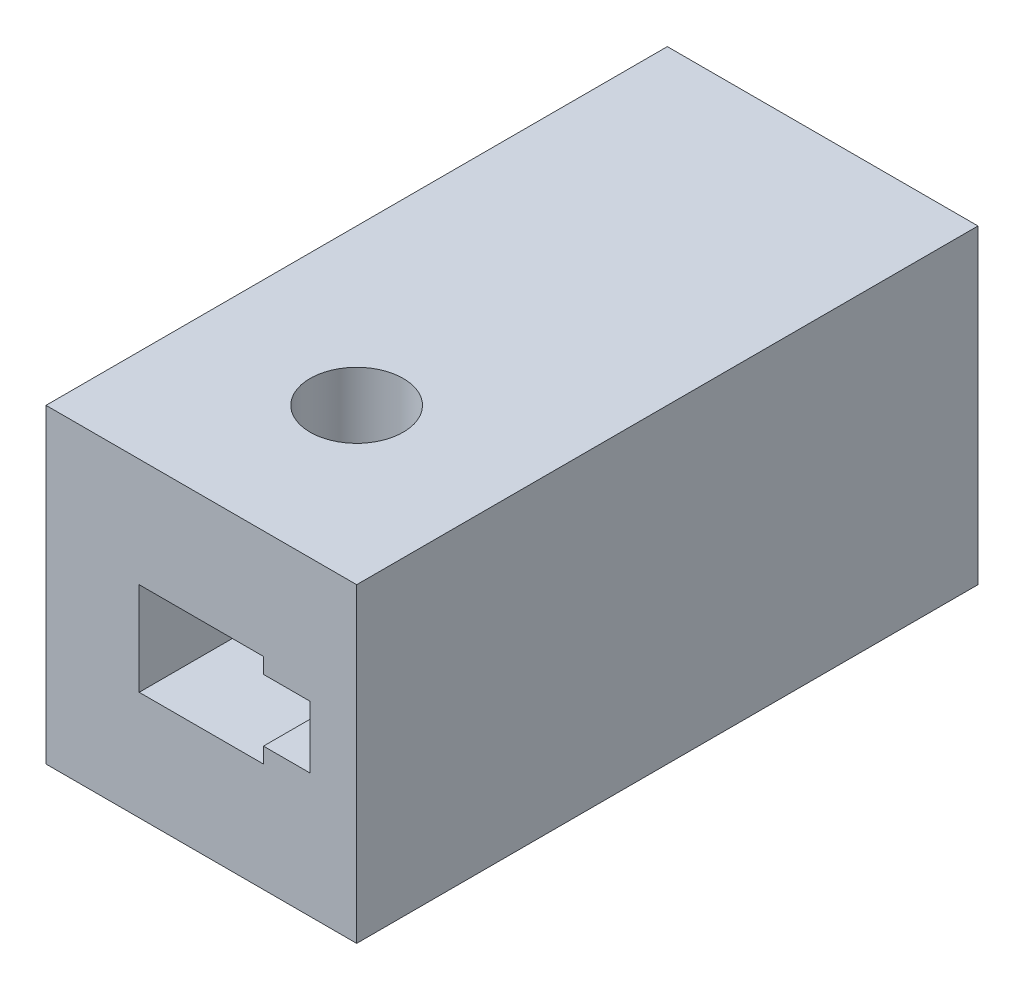
ISO-10303-21;
HEADER;
FILE_DESCRIPTION(('STEP AP214'),'2;1');
FILE_NAME('part.step','',(''),(''),'','','');
FILE_SCHEMA(('AUTOMOTIVE_DESIGN { 1 0 10303 214 1 1 1 1 }'));
ENDSEC;
DATA;
#1=APPLICATION_CONTEXT('core data for automotive mechanical design processes');
#2=APPLICATION_PROTOCOL_DEFINITION('international standard','automotive_design',2000,#1);
#3=PRODUCT_CONTEXT('',#1,'mechanical');
#4=PRODUCT('Part','Part','',(#3));
#5=PRODUCT_RELATED_PRODUCT_CATEGORY('part','',(#4));
#6=PRODUCT_DEFINITION_FORMATION('','',#4);
#7=PRODUCT_DEFINITION_CONTEXT('part definition',#1,'design');
#8=PRODUCT_DEFINITION('design','',#6,#7);
#9=PRODUCT_DEFINITION_SHAPE('','',#8);
#10=(LENGTH_UNIT() NAMED_UNIT(*) SI_UNIT(.MILLI.,.METRE.));
#11=(NAMED_UNIT(*) PLANE_ANGLE_UNIT() SI_UNIT($,.RADIAN.));
#12=(NAMED_UNIT(*) SI_UNIT($,.STERADIAN.) SOLID_ANGLE_UNIT());
#13=UNCERTAINTY_MEASURE_WITH_UNIT(LENGTH_MEASURE(1.E-05),#10,'distance_accuracy_value','');
#14=(GEOMETRIC_REPRESENTATION_CONTEXT(3) GLOBAL_UNCERTAINTY_ASSIGNED_CONTEXT((#13)) GLOBAL_UNIT_ASSIGNED_CONTEXT((#10,
#11,#12)) REPRESENTATION_CONTEXT('',''));
#15=CARTESIAN_POINT('',(0.,0.,0.));
#16=DIRECTION('',(0.,0.,1.));
#17=DIRECTION('',(1.,0.,0.));
#18=AXIS2_PLACEMENT_3D('',#15,#16,#17);
#19=CARTESIAN_POINT('',(0.,-5.,20.));
#20=DIRECTION('',(0.,1.,0.));
#21=DIRECTION('',(0.,0.,1.));
#22=AXIS2_PLACEMENT_3D('',#19,#20,#21);
#23=PLANE('',#22);
#24=CARTESIAN_POINT('',(0.,-5.,15.));
#25=DIRECTION('',(0.,-1.,0.));
#26=DIRECTION('',(0.,0.,-1.));
#27=AXIS2_PLACEMENT_3D('',#24,#25,#26);
#28=CIRCLE('',#27,1.5);
#29=CARTESIAN_POINT('',(0.,-5.,13.5));
#30=VERTEX_POINT('',#29);
#31=EDGE_CURVE('E294',#30,#30,#28,.T.);
#32=ORIENTED_EDGE('',*,*,#31,.F.);
#33=EDGE_LOOP('',(#32));
#34=FACE_BOUND('',#33,.T.);
#35=DIRECTION('',(1.,0.,0.));
#36=VECTOR('',#35,1.);
#37=CARTESIAN_POINT('',(0.,-5.,0.));
#38=LINE('',#37,#36);
#39=CARTESIAN_POINT('',(-5.,-5.,0.));
#40=VERTEX_POINT('',#39);
#41=CARTESIAN_POINT('',(5.,-5.,0.));
#42=VERTEX_POINT('',#41);
#43=EDGE_CURVE('E181',#40,#42,#38,.T.);
#44=ORIENTED_EDGE('',*,*,#43,.T.);
#45=DIRECTION('',(0.,0.,-1.));
#46=VECTOR('',#45,1.);
#47=CARTESIAN_POINT('',(5.,-5.,20.));
#48=LINE('',#47,#46);
#49=CARTESIAN_POINT('',(5.,-5.,20.));
#50=VERTEX_POINT('',#49);
#51=EDGE_CURVE('E11',#50,#42,#48,.T.);
#52=ORIENTED_EDGE('',*,*,#51,.F.);
#53=DIRECTION('',(1.,0.,0.));
#54=VECTOR('',#53,1.);
#55=CARTESIAN_POINT('',(0.,-5.,20.));
#56=LINE('',#55,#54);
#57=CARTESIAN_POINT('',(-5.,-5.,20.));
#58=VERTEX_POINT('',#57);
#59=EDGE_CURVE('E142',#58,#50,#56,.T.);
#60=ORIENTED_EDGE('',*,*,#59,.F.);
#61=DIRECTION('',(0.,0.,-1.));
#62=VECTOR('',#61,1.);
#63=CARTESIAN_POINT('',(-5.,-5.,20.));
#64=LINE('',#63,#62);
#65=EDGE_CURVE('E57',#58,#40,#64,.T.);
#66=ORIENTED_EDGE('',*,*,#65,.T.);
#67=EDGE_LOOP('',(#44,#52,#60,#66));
#68=FACE_BOUND('',#67,.T.);
#69=ADVANCED_FACE('F38',(#34,#68),#23,.F.);
#70=CARTESIAN_POINT('',(5.,0.,20.));
#71=DIRECTION('',(-1.,0.,0.));
#72=DIRECTION('',(0.,0.,1.));
#73=AXIS2_PLACEMENT_3D('',#70,#71,#72);
#74=PLANE('',#73);
#75=DIRECTION('',(0.,1.,0.));
#76=VECTOR('',#75,1.);
#77=CARTESIAN_POINT('',(5.,0.,0.));
#78=LINE('',#77,#76);
#79=CARTESIAN_POINT('',(5.,5.,0.));
#80=VERTEX_POINT('',#79);
#81=EDGE_CURVE('E148',#42,#80,#78,.T.);
#82=ORIENTED_EDGE('',*,*,#81,.T.);
#83=DIRECTION('',(0.,0.,-1.));
#84=VECTOR('',#83,1.);
#85=CARTESIAN_POINT('',(5.,5.,20.));
#86=LINE('',#85,#84);
#87=CARTESIAN_POINT('',(5.,5.,20.));
#88=VERTEX_POINT('',#87);
#89=EDGE_CURVE('E48',#88,#80,#86,.T.);
#90=ORIENTED_EDGE('',*,*,#89,.F.);
#91=DIRECTION('',(0.,1.,0.));
#92=VECTOR('',#91,1.);
#93=CARTESIAN_POINT('',(5.,0.,20.));
#94=LINE('',#93,#92);
#95=EDGE_CURVE('E136',#50,#88,#94,.T.);
#96=ORIENTED_EDGE('',*,*,#95,.F.);
#97=ORIENTED_EDGE('',*,*,#51,.T.);
#98=EDGE_LOOP('',(#82,#90,#96,#97));
#99=FACE_BOUND('',#98,.T.);
#100=ADVANCED_FACE('F147',(#99),#74,.F.);
#101=CARTESIAN_POINT('',(0.,5.,20.));
#102=DIRECTION('',(0.,1.,0.));
#103=DIRECTION('',(0.,0.,1.));
#104=AXIS2_PLACEMENT_3D('',#101,#102,#103);
#105=PLANE('',#104);
#106=CARTESIAN_POINT('',(0.,5.,15.));
#107=DIRECTION('',(0.,1.,0.));
#108=DIRECTION('',(0.,0.,1.));
#109=AXIS2_PLACEMENT_3D('',#106,#107,#108);
#110=CIRCLE('',#109,1.5);
#111=CARTESIAN_POINT('',(0.,5.,16.5));
#112=VERTEX_POINT('',#111);
#113=EDGE_CURVE('E163',#112,#112,#110,.T.);
#114=ORIENTED_EDGE('',*,*,#113,.F.);
#115=EDGE_LOOP('',(#114));
#116=FACE_BOUND('',#115,.T.);
#117=DIRECTION('',(1.,0.,0.));
#118=VECTOR('',#117,1.);
#119=CARTESIAN_POINT('',(0.,5.,0.));
#120=LINE('',#119,#118);
#121=CARTESIAN_POINT('',(-5.,5.,0.));
#122=VERTEX_POINT('',#121);
#123=EDGE_CURVE('E184',#122,#80,#120,.T.);
#124=ORIENTED_EDGE('',*,*,#123,.F.);
#125=DIRECTION('',(0.,0.,-1.));
#126=VECTOR('',#125,1.);
#127=CARTESIAN_POINT('',(-5.,5.,20.));
#128=LINE('',#127,#126);
#129=CARTESIAN_POINT('',(-5.,5.,20.));
#130=VERTEX_POINT('',#129);
#131=EDGE_CURVE('E95',#130,#122,#128,.T.);
#132=ORIENTED_EDGE('',*,*,#131,.F.);
#133=DIRECTION('',(1.,0.,0.));
#134=VECTOR('',#133,1.);
#135=CARTESIAN_POINT('',(0.,5.,20.));
#136=LINE('',#135,#134);
#137=EDGE_CURVE('E141',#130,#88,#136,.T.);
#138=ORIENTED_EDGE('',*,*,#137,.T.);
#139=ORIENTED_EDGE('',*,*,#89,.T.);
#140=EDGE_LOOP('',(#124,#132,#138,#139));
#141=FACE_BOUND('',#140,.T.);
#142=ADVANCED_FACE('F152',(#116,#141),#105,.T.);
#143=CARTESIAN_POINT('',(3.5,0.,20.));
#144=DIRECTION('',(-1.,0.,0.));
#145=DIRECTION('',(0.,0.,1.));
#146=AXIS2_PLACEMENT_3D('',#143,#144,#145);
#147=PLANE('',#146);
#148=DIRECTION('',(0.,1.,0.));
#149=VECTOR('',#148,1.);
#150=CARTESIAN_POINT('',(3.5,0.,0.));
#151=LINE('',#150,#149);
#152=CARTESIAN_POINT('',(3.5,-1.,0.));
#153=VERTEX_POINT('',#152);
#154=CARTESIAN_POINT('',(3.5,0.999999999999998,0.));
#155=VERTEX_POINT('',#154);
#156=EDGE_CURVE('E159',#153,#155,#151,.T.);
#157=ORIENTED_EDGE('',*,*,#156,.F.);
#158=DIRECTION('',(0.,0.,-1.));
#159=VECTOR('',#158,1.);
#160=CARTESIAN_POINT('',(3.5,-1.,20.));
#161=LINE('',#160,#159);
#162=CARTESIAN_POINT('',(3.5,-1.,20.));
#163=VERTEX_POINT('',#162);
#164=EDGE_CURVE('E107',#163,#153,#161,.T.);
#165=ORIENTED_EDGE('',*,*,#164,.F.);
#166=DIRECTION('',(0.,1.,0.));
#167=VECTOR('',#166,1.);
#168=CARTESIAN_POINT('',(3.5,0.,20.));
#169=LINE('',#168,#167);
#170=CARTESIAN_POINT('',(3.5,0.999999999999998,20.));
#171=VERTEX_POINT('',#170);
#172=EDGE_CURVE('E189',#163,#171,#169,.T.);
#173=ORIENTED_EDGE('',*,*,#172,.T.);
#174=DIRECTION('',(0.,0.,-1.));
#175=VECTOR('',#174,1.);
#176=CARTESIAN_POINT('',(3.5,0.999999999999998,20.));
#177=LINE('',#176,#175);
#178=EDGE_CURVE('E155',#171,#155,#177,.T.);
#179=ORIENTED_EDGE('',*,*,#178,.T.);
#180=EDGE_LOOP('',(#157,#165,#173,#179));
#181=FACE_BOUND('',#180,.T.);
#182=ADVANCED_FACE('F40',(#181),#147,.T.);
#183=CARTESIAN_POINT('',(0.,-1.,20.));
#184=DIRECTION('',(0.,1.,0.));
#185=DIRECTION('',(0.,0.,1.));
#186=AXIS2_PLACEMENT_3D('',#183,#184,#185);
#187=PLANE('',#186);
#188=DIRECTION('',(1.,0.,0.));
#189=VECTOR('',#188,1.);
#190=CARTESIAN_POINT('',(0.,-1.,0.));
#191=LINE('',#190,#189);
#192=CARTESIAN_POINT('',(2.,-1.,0.));
#193=VERTEX_POINT('',#192);
#194=EDGE_CURVE('E162',#193,#153,#191,.T.);
#195=ORIENTED_EDGE('',*,*,#194,.F.);
#196=DIRECTION('',(0.,0.,-1.));
#197=VECTOR('',#196,1.);
#198=CARTESIAN_POINT('',(2.,-1.,20.));
#199=LINE('',#198,#197);
#200=CARTESIAN_POINT('',(2.,-1.,20.));
#201=VERTEX_POINT('',#200);
#202=EDGE_CURVE('E204',#201,#193,#199,.T.);
#203=ORIENTED_EDGE('',*,*,#202,.F.);
#204=DIRECTION('',(1.,0.,0.));
#205=VECTOR('',#204,1.);
#206=CARTESIAN_POINT('',(0.,-1.,20.));
#207=LINE('',#206,#205);
#208=EDGE_CURVE('E210',#201,#163,#207,.T.);
#209=ORIENTED_EDGE('',*,*,#208,.T.);
#210=ORIENTED_EDGE('',*,*,#164,.T.);
#211=EDGE_LOOP('',(#195,#203,#209,#210));
#212=FACE_BOUND('',#211,.T.);
#213=ADVANCED_FACE('F208',(#212),#187,.T.);
#214=CARTESIAN_POINT('',(2.,0.,20.));
#215=DIRECTION('',(-1.,0.,0.));
#216=DIRECTION('',(0.,0.,1.));
#217=AXIS2_PLACEMENT_3D('',#214,#215,#216);
#218=PLANE('',#217);
#219=DIRECTION('',(0.,1.,0.));
#220=VECTOR('',#219,1.);
#221=CARTESIAN_POINT('',(2.,0.,0.));
#222=LINE('',#221,#220);
#223=CARTESIAN_POINT('',(2.,-1.5,0.));
#224=VERTEX_POINT('',#223);
#225=EDGE_CURVE('E166',#224,#193,#222,.T.);
#226=ORIENTED_EDGE('',*,*,#225,.F.);
#227=DIRECTION('',(0.,0.,-1.));
#228=VECTOR('',#227,1.);
#229=CARTESIAN_POINT('',(2.,-1.5,20.));
#230=LINE('',#229,#228);
#231=CARTESIAN_POINT('',(2.,-1.5,20.));
#232=VERTEX_POINT('',#231);
#233=EDGE_CURVE('E202',#232,#224,#230,.T.);
#234=ORIENTED_EDGE('',*,*,#233,.F.);
#235=DIRECTION('',(0.,1.,0.));
#236=VECTOR('',#235,1.);
#237=CARTESIAN_POINT('',(2.,0.,20.));
#238=LINE('',#237,#236);
#239=EDGE_CURVE('E223',#232,#201,#238,.T.);
#240=ORIENTED_EDGE('',*,*,#239,.T.);
#241=ORIENTED_EDGE('',*,*,#202,.T.);
#242=EDGE_LOOP('',(#226,#234,#240,#241));
#243=FACE_BOUND('',#242,.T.);
#244=ADVANCED_FACE('F220',(#243),#218,.T.);
#245=CARTESIAN_POINT('',(0.,-1.5,20.));
#246=DIRECTION('',(0.,1.,0.));
#247=DIRECTION('',(0.,0.,1.));
#248=AXIS2_PLACEMENT_3D('',#245,#246,#247);
#249=PLANE('',#248);
#250=CARTESIAN_POINT('',(0.,-1.5,15.));
#251=DIRECTION('',(0.,1.,0.));
#252=DIRECTION('',(0.,0.,1.));
#253=AXIS2_PLACEMENT_3D('',#250,#251,#252);
#254=CIRCLE('',#253,1.5);
#255=CARTESIAN_POINT('',(0.,-1.5,16.5));
#256=VERTEX_POINT('',#255);
#257=EDGE_CURVE('E292',#256,#256,#254,.T.);
#258=ORIENTED_EDGE('',*,*,#257,.F.);
#259=EDGE_LOOP('',(#258));
#260=FACE_BOUND('',#259,.T.);
#261=DIRECTION('',(1.,0.,0.));
#262=VECTOR('',#261,1.);
#263=CARTESIAN_POINT('',(0.,-1.5,0.));
#264=LINE('',#263,#262);
#265=CARTESIAN_POINT('',(-2.,-1.5,0.));
#266=VERTEX_POINT('',#265);
#267=EDGE_CURVE('E169',#266,#224,#264,.T.);
#268=ORIENTED_EDGE('',*,*,#267,.F.);
#269=DIRECTION('',(0.,0.,-1.));
#270=VECTOR('',#269,1.);
#271=CARTESIAN_POINT('',(-2.,-1.5,20.));
#272=LINE('',#271,#270);
#273=CARTESIAN_POINT('',(-2.,-1.5,20.));
#274=VERTEX_POINT('',#273);
#275=EDGE_CURVE('E200',#274,#266,#272,.T.);
#276=ORIENTED_EDGE('',*,*,#275,.F.);
#277=DIRECTION('',(1.,0.,0.));
#278=VECTOR('',#277,1.);
#279=CARTESIAN_POINT('',(0.,-1.5,20.));
#280=LINE('',#279,#278);
#281=EDGE_CURVE('E228',#274,#232,#280,.T.);
#282=ORIENTED_EDGE('',*,*,#281,.T.);
#283=ORIENTED_EDGE('',*,*,#233,.T.);
#284=EDGE_LOOP('',(#268,#276,#282,#283));
#285=FACE_BOUND('',#284,.T.);
#286=ADVANCED_FACE('F309',(#260,#285),#249,.T.);
#287=CARTESIAN_POINT('',(-2.,0.,20.));
#288=DIRECTION('',(-1.,0.,0.));
#289=DIRECTION('',(0.,0.,1.));
#290=AXIS2_PLACEMENT_3D('',#287,#288,#289);
#291=PLANE('',#290);
#292=DIRECTION('',(0.,1.,0.));
#293=VECTOR('',#292,1.);
#294=CARTESIAN_POINT('',(-2.,0.,0.));
#295=LINE('',#294,#293);
#296=CARTESIAN_POINT('',(-2.,1.5,0.));
#297=VERTEX_POINT('',#296);
#298=EDGE_CURVE('E173',#266,#297,#295,.T.);
#299=ORIENTED_EDGE('',*,*,#298,.T.);
#300=DIRECTION('',(0.,0.,-1.));
#301=VECTOR('',#300,1.);
#302=CARTESIAN_POINT('',(-2.,1.5,20.));
#303=LINE('',#302,#301);
#304=CARTESIAN_POINT('',(-2.,1.5,20.));
#305=VERTEX_POINT('',#304);
#306=EDGE_CURVE('E197',#305,#297,#303,.T.);
#307=ORIENTED_EDGE('',*,*,#306,.F.);
#308=DIRECTION('',(0.,1.,0.));
#309=VECTOR('',#308,1.);
#310=CARTESIAN_POINT('',(-2.,0.,20.));
#311=LINE('',#310,#309);
#312=EDGE_CURVE('E235',#274,#305,#311,.T.);
#313=ORIENTED_EDGE('',*,*,#312,.F.);
#314=ORIENTED_EDGE('',*,*,#275,.T.);
#315=EDGE_LOOP('',(#299,#307,#313,#314));
#316=FACE_BOUND('',#315,.T.);
#317=ADVANCED_FACE('F304',(#316),#291,.F.);
#318=CARTESIAN_POINT('',(0.,1.5,20.));
#319=DIRECTION('',(0.,1.,0.));
#320=DIRECTION('',(0.,0.,1.));
#321=AXIS2_PLACEMENT_3D('',#318,#319,#320);
#322=PLANE('',#321);
#323=CARTESIAN_POINT('',(0.,1.5,15.));
#324=DIRECTION('',(0.,1.,0.));
#325=DIRECTION('',(0.,0.,1.));
#326=AXIS2_PLACEMENT_3D('',#323,#324,#325);
#327=CIRCLE('',#326,1.5);
#328=CARTESIAN_POINT('',(0.,1.5,16.5));
#329=VERTEX_POINT('',#328);
#330=EDGE_CURVE('E42',#329,#329,#327,.T.);
#331=ORIENTED_EDGE('',*,*,#330,.T.);
#332=EDGE_LOOP('',(#331));
#333=FACE_BOUND('',#332,.T.);
#334=DIRECTION('',(1.,0.,0.));
#335=VECTOR('',#334,1.);
#336=CARTESIAN_POINT('',(0.,1.5,0.));
#337=LINE('',#336,#335);
#338=CARTESIAN_POINT('',(2.,1.5,0.));
#339=VERTEX_POINT('',#338);
#340=EDGE_CURVE('E175',#297,#339,#337,.T.);
#341=ORIENTED_EDGE('',*,*,#340,.T.);
#342=DIRECTION('',(0.,0.,-1.));
#343=VECTOR('',#342,1.);
#344=CARTESIAN_POINT('',(2.,1.5,20.));
#345=LINE('',#344,#343);
#346=CARTESIAN_POINT('',(2.,1.5,20.));
#347=VERTEX_POINT('',#346);
#348=EDGE_CURVE('E195',#347,#339,#345,.T.);
#349=ORIENTED_EDGE('',*,*,#348,.F.);
#350=DIRECTION('',(1.,0.,0.));
#351=VECTOR('',#350,1.);
#352=CARTESIAN_POINT('',(0.,1.5,20.));
#353=LINE('',#352,#351);
#354=EDGE_CURVE('E237',#305,#347,#353,.T.);
#355=ORIENTED_EDGE('',*,*,#354,.F.);
#356=ORIENTED_EDGE('',*,*,#306,.T.);
#357=EDGE_LOOP('',(#341,#349,#355,#356));
#358=FACE_BOUND('',#357,.T.);
#359=ADVANCED_FACE('F251',(#333,#358),#322,.F.);
#360=CARTESIAN_POINT('',(2.,0.999999999999998,0.));
#361=VERTEX_POINT('',#360);
#362=EDGE_CURVE('E170',#361,#339,#222,.T.);
#363=ORIENTED_EDGE('',*,*,#362,.F.);
#364=DIRECTION('',(0.,0.,-1.));
#365=VECTOR('',#364,1.);
#366=CARTESIAN_POINT('',(2.,0.999999999999998,20.));
#367=LINE('',#366,#365);
#368=CARTESIAN_POINT('',(2.,0.999999999999998,20.));
#369=VERTEX_POINT('',#368);
#370=EDGE_CURVE('E193',#369,#361,#367,.T.);
#371=ORIENTED_EDGE('',*,*,#370,.F.);
#372=EDGE_CURVE('E230',#369,#347,#238,.T.);
#373=ORIENTED_EDGE('',*,*,#372,.T.);
#374=ORIENTED_EDGE('',*,*,#348,.T.);
#375=EDGE_LOOP('',(#363,#371,#373,#374));
#376=FACE_BOUND('',#375,.T.);
#377=ADVANCED_FACE('F245',(#376),#218,.T.);
#378=CARTESIAN_POINT('',(0.,0.999999999999998,20.));
#379=DIRECTION('',(0.,1.,0.));
#380=DIRECTION('',(0.,0.,1.));
#381=AXIS2_PLACEMENT_3D('',#378,#379,#380);
#382=PLANE('',#381);
#383=DIRECTION('',(1.,0.,0.));
#384=VECTOR('',#383,1.);
#385=CARTESIAN_POINT('',(0.,0.999999999999998,0.));
#386=LINE('',#385,#384);
#387=EDGE_CURVE('E178',#361,#155,#386,.T.);
#388=ORIENTED_EDGE('',*,*,#387,.T.);
#389=ORIENTED_EDGE('',*,*,#178,.F.);
#390=DIRECTION('',(1.,0.,0.));
#391=VECTOR('',#390,1.);
#392=CARTESIAN_POINT('',(0.,0.999999999999998,20.));
#393=LINE('',#392,#391);
#394=EDGE_CURVE('E239',#369,#171,#393,.T.);
#395=ORIENTED_EDGE('',*,*,#394,.F.);
#396=ORIENTED_EDGE('',*,*,#370,.T.);
#397=EDGE_LOOP('',(#388,#389,#395,#396));
#398=FACE_BOUND('',#397,.T.);
#399=ADVANCED_FACE('F255',(#398),#382,.F.);
#400=CARTESIAN_POINT('',(-5.,0.,20.));
#401=DIRECTION('',(-1.,0.,0.));
#402=DIRECTION('',(0.,0.,1.));
#403=AXIS2_PLACEMENT_3D('',#400,#401,#402);
#404=PLANE('',#403);
#405=DIRECTION('',(0.,1.,0.));
#406=VECTOR('',#405,1.);
#407=CARTESIAN_POINT('',(-5.,0.,0.));
#408=LINE('',#407,#406);
#409=EDGE_CURVE('E186',#40,#122,#408,.T.);
#410=ORIENTED_EDGE('',*,*,#409,.F.);
#411=ORIENTED_EDGE('',*,*,#65,.F.);
#412=DIRECTION('',(0.,1.,0.));
#413=VECTOR('',#412,1.);
#414=CARTESIAN_POINT('',(-5.,0.,20.));
#415=LINE('',#414,#413);
#416=EDGE_CURVE('E153',#58,#130,#415,.T.);
#417=ORIENTED_EDGE('',*,*,#416,.T.);
#418=ORIENTED_EDGE('',*,*,#131,.T.);
#419=EDGE_LOOP('',(#410,#411,#417,#418));
#420=FACE_BOUND('',#419,.T.);
#421=ADVANCED_FACE('F257',(#420),#404,.T.);
#422=CARTESIAN_POINT('',(0.,0.,20.));
#423=DIRECTION('',(0.,0.,1.));
#424=DIRECTION('',(1.,0.,0.));
#425=AXIS2_PLACEMENT_3D('',#422,#423,#424);
#426=PLANE('',#425);
#427=ORIENTED_EDGE('',*,*,#172,.F.);
#428=ORIENTED_EDGE('',*,*,#208,.F.);
#429=ORIENTED_EDGE('',*,*,#239,.F.);
#430=ORIENTED_EDGE('',*,*,#281,.F.);
#431=ORIENTED_EDGE('',*,*,#312,.T.);
#432=ORIENTED_EDGE('',*,*,#354,.T.);
#433=ORIENTED_EDGE('',*,*,#372,.F.);
#434=ORIENTED_EDGE('',*,*,#394,.T.);
#435=EDGE_LOOP('',(#427,#428,#429,#430,#431,#432,#433,#434));
#436=FACE_BOUND('',#435,.T.);
#437=ORIENTED_EDGE('',*,*,#59,.T.);
#438=ORIENTED_EDGE('',*,*,#95,.T.);
#439=ORIENTED_EDGE('',*,*,#137,.F.);
#440=ORIENTED_EDGE('',*,*,#416,.F.);
#441=EDGE_LOOP('',(#437,#438,#439,#440));
#442=FACE_BOUND('',#441,.T.);
#443=ADVANCED_FACE('F138',(#436,#442),#426,.T.);
#444=CARTESIAN_POINT('',(0.,0.,0.));
#445=DIRECTION('',(0.,0.,1.));
#446=DIRECTION('',(1.,0.,0.));
#447=AXIS2_PLACEMENT_3D('',#444,#445,#446);
#448=PLANE('',#447);
#449=ORIENTED_EDGE('',*,*,#156,.T.);
#450=ORIENTED_EDGE('',*,*,#387,.F.);
#451=ORIENTED_EDGE('',*,*,#362,.T.);
#452=ORIENTED_EDGE('',*,*,#340,.F.);
#453=ORIENTED_EDGE('',*,*,#298,.F.);
#454=ORIENTED_EDGE('',*,*,#267,.T.);
#455=ORIENTED_EDGE('',*,*,#225,.T.);
#456=ORIENTED_EDGE('',*,*,#194,.T.);
#457=EDGE_LOOP('',(#449,#450,#451,#452,#453,#454,#455,#456));
#458=FACE_BOUND('',#457,.T.);
#459=ORIENTED_EDGE('',*,*,#43,.F.);
#460=ORIENTED_EDGE('',*,*,#409,.T.);
#461=ORIENTED_EDGE('',*,*,#123,.T.);
#462=ORIENTED_EDGE('',*,*,#81,.F.);
#463=EDGE_LOOP('',(#459,#460,#461,#462));
#464=FACE_BOUND('',#463,.T.);
#465=ADVANCED_FACE('F214',(#458,#464),#448,.F.);
#466=CARTESIAN_POINT('',(0.,15.,15.));
#467=DIRECTION('',(0.,-1.,0.));
#468=DIRECTION('',(0.,0.,-1.));
#469=AXIS2_PLACEMENT_3D('',#466,#467,#468);
#470=CYLINDRICAL_SURFACE('',#469,1.5);
#471=ORIENTED_EDGE('',*,*,#113,.T.);
#472=EDGE_LOOP('',(#471));
#473=FACE_BOUND('',#472,.T.);
#474=ORIENTED_EDGE('',*,*,#330,.F.);
#475=EDGE_LOOP('',(#474));
#476=FACE_BOUND('',#475,.T.);
#477=ADVANCED_FACE('F279',(#473,#476),#470,.F.);
#478=ORIENTED_EDGE('',*,*,#257,.T.);
#479=EDGE_LOOP('',(#478));
#480=FACE_BOUND('',#479,.T.);
#481=ORIENTED_EDGE('',*,*,#31,.T.);
#482=EDGE_LOOP('',(#481));
#483=FACE_BOUND('',#482,.T.);
#484=ADVANCED_FACE('F282',(#480,#483),#470,.F.);
#485=CLOSED_SHELL('',(#69,#100,#142,#182,#213,#244,#286,#317,#359,#377,#399,#421,#443,#465,#477,#484));
#486=MANIFOLD_SOLID_BREP('B2',#485);
#487=ADVANCED_BREP_SHAPE_REPRESENTATION('',(#18,#486),#14);
#488=SHAPE_DEFINITION_REPRESENTATION(#9,#487);
ENDSEC;
END-ISO-10303-21;
